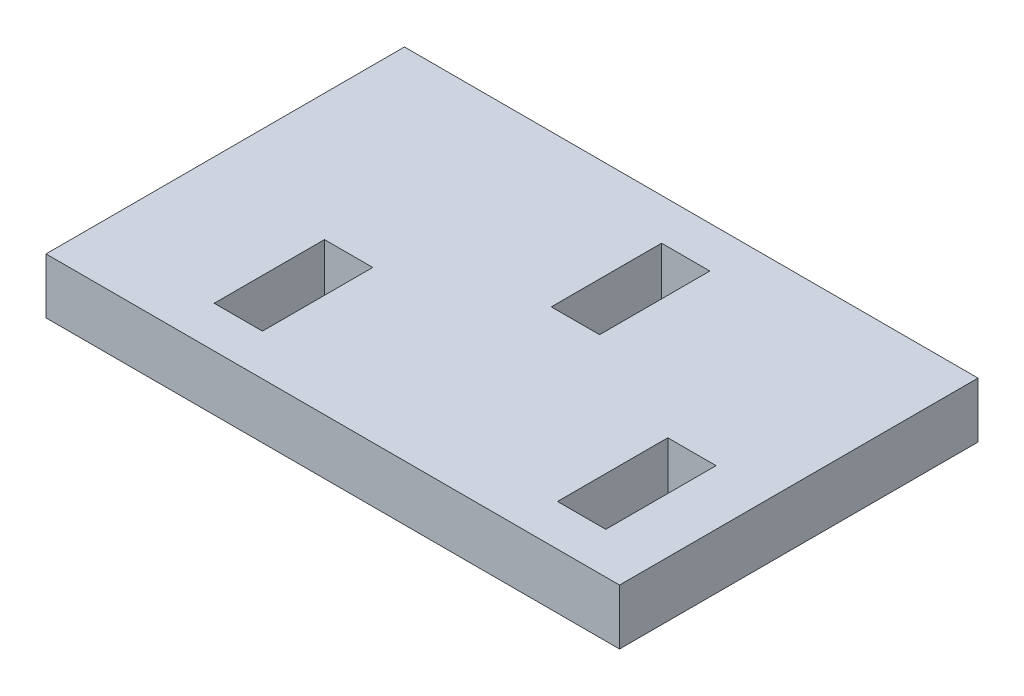
ISO-10303-21;
HEADER;
FILE_DESCRIPTION(('STEP AP214'),'2;1');
FILE_NAME('part.step','',(''),(''),'','','');
FILE_SCHEMA(('AUTOMOTIVE_DESIGN { 1 0 10303 214 1 1 1 1 }'));
ENDSEC;
DATA;
#1=APPLICATION_CONTEXT('core data for automotive mechanical design processes');
#2=APPLICATION_PROTOCOL_DEFINITION('international standard','automotive_design',2000,#1);
#3=PRODUCT_CONTEXT('',#1,'mechanical');
#4=PRODUCT('Part','Part','',(#3));
#5=PRODUCT_RELATED_PRODUCT_CATEGORY('part','',(#4));
#6=PRODUCT_DEFINITION_FORMATION('','',#4);
#7=PRODUCT_DEFINITION_CONTEXT('part definition',#1,'design');
#8=PRODUCT_DEFINITION('design','',#6,#7);
#9=PRODUCT_DEFINITION_SHAPE('','',#8);
#10=(LENGTH_UNIT() NAMED_UNIT(*) SI_UNIT(.MILLI.,.METRE.));
#11=(NAMED_UNIT(*) PLANE_ANGLE_UNIT() SI_UNIT($,.RADIAN.));
#12=(NAMED_UNIT(*) SI_UNIT($,.STERADIAN.) SOLID_ANGLE_UNIT());
#13=UNCERTAINTY_MEASURE_WITH_UNIT(LENGTH_MEASURE(1.E-05),#10,'distance_accuracy_value','');
#14=(GEOMETRIC_REPRESENTATION_CONTEXT(3) GLOBAL_UNCERTAINTY_ASSIGNED_CONTEXT((#13)) GLOBAL_UNIT_ASSIGNED_CONTEXT((#10,
#11,#12)) REPRESENTATION_CONTEXT('',''));
#15=CARTESIAN_POINT('',(0.,0.,0.));
#16=DIRECTION('',(0.,0.,1.));
#17=DIRECTION('',(1.,0.,0.));
#18=AXIS2_PLACEMENT_3D('',#15,#16,#17);
#19=CARTESIAN_POINT('',(26.416,5.1054,16.51));
#20=DIRECTION('',(-1.,0.,0.));
#21=DIRECTION('',(0.,0.,1.));
#22=AXIS2_PLACEMENT_3D('',#19,#20,#21);
#23=PLANE('',#22);
#24=DIRECTION('',(0.,0.,-1.));
#25=VECTOR('',#24,1.);
#26=CARTESIAN_POINT('',(26.416,0.,16.51));
#27=LINE('',#26,#25);
#28=CARTESIAN_POINT('',(26.416,0.,16.51));
#29=VERTEX_POINT('',#28);
#30=CARTESIAN_POINT('',(26.416,0.,-16.51));
#31=VERTEX_POINT('',#30);
#32=EDGE_CURVE('E238',#29,#31,#27,.T.);
#33=ORIENTED_EDGE('',*,*,#32,.T.);
#34=DIRECTION('',(0.,-1.,0.));
#35=VECTOR('',#34,1.);
#36=CARTESIAN_POINT('',(26.416,5.1054,-16.51));
#37=LINE('',#36,#35);
#38=CARTESIAN_POINT('',(26.416,5.1054,-16.51));
#39=VERTEX_POINT('',#38);
#40=EDGE_CURVE('E11',#39,#31,#37,.T.);
#41=ORIENTED_EDGE('',*,*,#40,.F.);
#42=DIRECTION('',(0.,0.,-1.));
#43=VECTOR('',#42,1.);
#44=CARTESIAN_POINT('',(26.416,5.1054,16.51));
#45=LINE('',#44,#43);
#46=CARTESIAN_POINT('',(26.416,5.1054,16.51));
#47=VERTEX_POINT('',#46);
#48=EDGE_CURVE('E245',#47,#39,#45,.T.);
#49=ORIENTED_EDGE('',*,*,#48,.F.);
#50=DIRECTION('',(0.,-1.,0.));
#51=VECTOR('',#50,1.);
#52=CARTESIAN_POINT('',(26.416,5.1054,16.51));
#53=LINE('',#52,#51);
#54=EDGE_CURVE('E255',#47,#29,#53,.T.);
#55=ORIENTED_EDGE('',*,*,#54,.T.);
#56=EDGE_LOOP('',(#33,#41,#49,#55));
#57=FACE_BOUND('',#56,.T.);
#58=ADVANCED_FACE('F32',(#57),#23,.F.);
#59=CARTESIAN_POINT('',(-26.416,5.1054,-16.51));
#60=DIRECTION('',(0.,0.,1.));
#61=DIRECTION('',(1.,0.,0.));
#62=AXIS2_PLACEMENT_3D('',#59,#60,#61);
#63=PLANE('',#62);
#64=DIRECTION('',(-1.,0.,0.));
#65=VECTOR('',#64,1.);
#66=CARTESIAN_POINT('',(-26.416,0.,-16.51));
#67=LINE('',#66,#65);
#68=CARTESIAN_POINT('',(-26.416,0.,-16.51));
#69=VERTEX_POINT('',#68);
#70=EDGE_CURVE('E258',#31,#69,#67,.T.);
#71=ORIENTED_EDGE('',*,*,#70,.T.);
#72=DIRECTION('',(0.,-1.,0.));
#73=VECTOR('',#72,1.);
#74=CARTESIAN_POINT('',(-26.416,5.1054,-16.51));
#75=LINE('',#74,#73);
#76=CARTESIAN_POINT('',(-26.416,5.1054,-16.51));
#77=VERTEX_POINT('',#76);
#78=EDGE_CURVE('E39',#77,#69,#75,.T.);
#79=ORIENTED_EDGE('',*,*,#78,.F.);
#80=DIRECTION('',(-1.,0.,0.));
#81=VECTOR('',#80,1.);
#82=CARTESIAN_POINT('',(-26.416,5.1054,-16.51));
#83=LINE('',#82,#81);
#84=EDGE_CURVE('E248',#39,#77,#83,.T.);
#85=ORIENTED_EDGE('',*,*,#84,.F.);
#86=ORIENTED_EDGE('',*,*,#40,.T.);
#87=EDGE_LOOP('',(#71,#79,#85,#86));
#88=FACE_BOUND('',#87,.T.);
#89=ADVANCED_FACE('F287',(#88),#63,.F.);
#90=CARTESIAN_POINT('',(-26.416,5.1054,16.51));
#91=DIRECTION('',(1.,0.,0.));
#92=DIRECTION('',(0.,0.,-1.));
#93=AXIS2_PLACEMENT_3D('',#90,#91,#92);
#94=PLANE('',#93);
#95=DIRECTION('',(0.,0.,1.));
#96=VECTOR('',#95,1.);
#97=CARTESIAN_POINT('',(-26.416,0.,16.51));
#98=LINE('',#97,#96);
#99=CARTESIAN_POINT('',(-26.416,0.,16.51));
#100=VERTEX_POINT('',#99);
#101=EDGE_CURVE('E260',#69,#100,#98,.T.);
#102=ORIENTED_EDGE('',*,*,#101,.T.);
#103=DIRECTION('',(0.,-1.,0.));
#104=VECTOR('',#103,1.);
#105=CARTESIAN_POINT('',(-26.416,5.1054,16.51));
#106=LINE('',#105,#104);
#107=CARTESIAN_POINT('',(-26.416,5.1054,16.51));
#108=VERTEX_POINT('',#107);
#109=EDGE_CURVE('E265',#108,#100,#106,.T.);
#110=ORIENTED_EDGE('',*,*,#109,.F.);
#111=DIRECTION('',(0.,0.,1.));
#112=VECTOR('',#111,1.);
#113=CARTESIAN_POINT('',(-26.416,5.1054,16.51));
#114=LINE('',#113,#112);
#115=EDGE_CURVE('E251',#77,#108,#114,.T.);
#116=ORIENTED_EDGE('',*,*,#115,.F.);
#117=ORIENTED_EDGE('',*,*,#78,.T.);
#118=EDGE_LOOP('',(#102,#110,#116,#117));
#119=FACE_BOUND('',#118,.T.);
#120=ADVANCED_FACE('F272',(#119),#94,.F.);
#121=CARTESIAN_POINT('',(-26.416,5.1054,16.51));
#122=DIRECTION('',(0.,0.,-1.));
#123=DIRECTION('',(-1.,0.,0.));
#124=AXIS2_PLACEMENT_3D('',#121,#122,#123);
#125=PLANE('',#124);
#126=DIRECTION('',(1.,0.,0.));
#127=VECTOR('',#126,1.);
#128=CARTESIAN_POINT('',(-26.416,0.,16.51));
#129=LINE('',#128,#127);
#130=EDGE_CURVE('E249',#100,#29,#129,.T.);
#131=ORIENTED_EDGE('',*,*,#130,.T.);
#132=ORIENTED_EDGE('',*,*,#54,.F.);
#133=DIRECTION('',(1.,0.,0.));
#134=VECTOR('',#133,1.);
#135=CARTESIAN_POINT('',(-26.416,5.1054,16.51));
#136=LINE('',#135,#134);
#137=EDGE_CURVE('E253',#108,#47,#136,.T.);
#138=ORIENTED_EDGE('',*,*,#137,.F.);
#139=ORIENTED_EDGE('',*,*,#109,.T.);
#140=EDGE_LOOP('',(#131,#132,#138,#139));
#141=FACE_BOUND('',#140,.T.);
#142=ADVANCED_FACE('F280',(#141),#125,.F.);
#143=CARTESIAN_POINT('',(26.416,5.1054,-16.51));
#144=DIRECTION('',(0.,-1.,0.));
#145=DIRECTION('',(0.,0.,-1.));
#146=AXIS2_PLACEMENT_3D('',#143,#144,#145);
#147=PLANE('',#146);
#148=DIRECTION('',(0.,0.,1.));
#149=VECTOR('',#148,1.);
#150=CARTESIAN_POINT('',(-14.732,5.1054,12.7));
#151=LINE('',#150,#149);
#152=CARTESIAN_POINT('',(-14.7319999999999,5.1054,2.54000000000002));
#153=VERTEX_POINT('',#152);
#154=CARTESIAN_POINT('',(-14.732,5.1054,12.7));
#155=VERTEX_POINT('',#154);
#156=EDGE_CURVE('E171',#153,#155,#151,.T.);
#157=ORIENTED_EDGE('',*,*,#156,.F.);
#158=DIRECTION('',(-1.,0.,0.));
#159=VECTOR('',#158,1.);
#160=CARTESIAN_POINT('',(-14.7319999999999,5.1054,2.54000000000002));
#161=LINE('',#160,#159);
#162=CARTESIAN_POINT('',(-10.2869999999999,5.1054,2.54000000000002));
#163=VERTEX_POINT('',#162);
#164=EDGE_CURVE('E46',#163,#153,#161,.T.);
#165=ORIENTED_EDGE('',*,*,#164,.F.);
#166=DIRECTION('',(0.,0.,-1.));
#167=VECTOR('',#166,1.);
#168=CARTESIAN_POINT('',(-10.2869999999999,5.1054,2.54000000000002));
#169=LINE('',#168,#167);
#170=CARTESIAN_POINT('',(-10.287,5.1054,12.7));
#171=VERTEX_POINT('',#170);
#172=EDGE_CURVE('E162',#171,#163,#169,.T.);
#173=ORIENTED_EDGE('',*,*,#172,.F.);
#174=DIRECTION('',(1.,0.,0.));
#175=VECTOR('',#174,1.);
#176=CARTESIAN_POINT('',(-10.287,5.1054,12.7));
#177=LINE('',#176,#175);
#178=EDGE_CURVE('E165',#155,#171,#177,.T.);
#179=ORIENTED_EDGE('',*,*,#178,.F.);
#180=EDGE_LOOP('',(#157,#165,#173,#179));
#181=FACE_BOUND('',#180,.T.);
#182=DIRECTION('',(-1.,0.,0.));
#183=VECTOR('',#182,1.);
#184=CARTESIAN_POINT('',(1.07950000000006,5.1054,-12.7));
#185=LINE('',#184,#183);
#186=CARTESIAN_POINT('',(5.52450000000006,5.1054,-12.7));
#187=VERTEX_POINT('',#186);
#188=CARTESIAN_POINT('',(1.07950000000006,5.1054,-12.7));
#189=VERTEX_POINT('',#188);
#190=EDGE_CURVE('E196',#187,#189,#185,.T.);
#191=ORIENTED_EDGE('',*,*,#190,.F.);
#192=DIRECTION('',(0.,0.,-1.));
#193=VECTOR('',#192,1.);
#194=CARTESIAN_POINT('',(5.52450000000006,5.1054,-12.7));
#195=LINE('',#194,#193);
#196=CARTESIAN_POINT('',(5.52450000000005,5.1054,-2.53999999999998));
#197=VERTEX_POINT('',#196);
#198=EDGE_CURVE('E177',#197,#187,#195,.T.);
#199=ORIENTED_EDGE('',*,*,#198,.F.);
#200=DIRECTION('',(1.,0.,0.));
#201=VECTOR('',#200,1.);
#202=CARTESIAN_POINT('',(5.52450000000005,5.1054,-2.53999999999998));
#203=LINE('',#202,#201);
#204=CARTESIAN_POINT('',(1.07950000000005,5.1054,-2.53999999999998));
#205=VERTEX_POINT('',#204);
#206=EDGE_CURVE('E185',#205,#197,#203,.T.);
#207=ORIENTED_EDGE('',*,*,#206,.F.);
#208=DIRECTION('',(0.,0.,1.));
#209=VECTOR('',#208,1.);
#210=CARTESIAN_POINT('',(1.07950000000005,5.1054,-2.53999999999998));
#211=LINE('',#210,#209);
#212=EDGE_CURVE('E199',#189,#205,#211,.T.);
#213=ORIENTED_EDGE('',*,*,#212,.F.);
#214=EDGE_LOOP('',(#191,#199,#207,#213));
#215=FACE_BOUND('',#214,.T.);
#216=DIRECTION('',(0.,0.,-1.));
#217=VECTOR('',#216,1.);
#218=CARTESIAN_POINT('',(21.336,5.1054,2.54000000000005));
#219=LINE('',#218,#217);
#220=CARTESIAN_POINT('',(21.336,5.1054,12.7000000000001));
#221=VERTEX_POINT('',#220);
#222=CARTESIAN_POINT('',(21.336,5.1054,2.54000000000005));
#223=VERTEX_POINT('',#222);
#224=EDGE_CURVE('E228',#221,#223,#219,.T.);
#225=ORIENTED_EDGE('',*,*,#224,.F.);
#226=DIRECTION('',(1.,0.,0.));
#227=VECTOR('',#226,1.);
#228=CARTESIAN_POINT('',(21.336,5.1054,12.7000000000001));
#229=LINE('',#228,#227);
#230=CARTESIAN_POINT('',(16.891,5.1054,12.7000000000001));
#231=VERTEX_POINT('',#230);
#232=EDGE_CURVE('E206',#231,#221,#229,.T.);
#233=ORIENTED_EDGE('',*,*,#232,.F.);
#234=DIRECTION('',(0.,0.,1.));
#235=VECTOR('',#234,1.);
#236=CARTESIAN_POINT('',(16.891,5.1054,12.7000000000001));
#237=LINE('',#236,#235);
#238=CARTESIAN_POINT('',(16.891,5.1054,2.54000000000005));
#239=VERTEX_POINT('',#238);
#240=EDGE_CURVE('E217',#239,#231,#237,.T.);
#241=ORIENTED_EDGE('',*,*,#240,.F.);
#242=DIRECTION('',(-1.,0.,0.));
#243=VECTOR('',#242,1.);
#244=CARTESIAN_POINT('',(16.891,5.1054,2.54000000000005));
#245=LINE('',#244,#243);
#246=EDGE_CURVE('E231',#223,#239,#245,.T.);
#247=ORIENTED_EDGE('',*,*,#246,.F.);
#248=EDGE_LOOP('',(#225,#233,#241,#247));
#249=FACE_BOUND('',#248,.T.);
#250=ORIENTED_EDGE('',*,*,#48,.T.);
#251=ORIENTED_EDGE('',*,*,#84,.T.);
#252=ORIENTED_EDGE('',*,*,#115,.T.);
#253=ORIENTED_EDGE('',*,*,#137,.T.);
#254=EDGE_LOOP('',(#250,#251,#252,#253));
#255=FACE_BOUND('',#254,.T.);
#256=ADVANCED_FACE('F286',(#181,#215,#249,#255),#147,.F.);
#257=CARTESIAN_POINT('',(26.416,0.,-16.51));
#258=DIRECTION('',(0.,-1.,0.));
#259=DIRECTION('',(0.,0.,-1.));
#260=AXIS2_PLACEMENT_3D('',#257,#258,#259);
#261=PLANE('',#260);
#262=DIRECTION('',(-1.,0.,0.));
#263=VECTOR('',#262,1.);
#264=CARTESIAN_POINT('',(-14.7319999999999,0.,2.54000000000002));
#265=LINE('',#264,#263);
#266=CARTESIAN_POINT('',(-10.2869999999999,0.,2.54000000000002));
#267=VERTEX_POINT('',#266);
#268=CARTESIAN_POINT('',(-14.7319999999999,0.,2.54000000000002));
#269=VERTEX_POINT('',#268);
#270=EDGE_CURVE('E146',#267,#269,#265,.T.);
#271=ORIENTED_EDGE('',*,*,#270,.T.);
#272=DIRECTION('',(0.,0.,1.));
#273=VECTOR('',#272,1.);
#274=CARTESIAN_POINT('',(-14.732,0.,12.7));
#275=LINE('',#274,#273);
#276=CARTESIAN_POINT('',(-14.732,0.,12.7));
#277=VERTEX_POINT('',#276);
#278=EDGE_CURVE('E155',#269,#277,#275,.T.);
#279=ORIENTED_EDGE('',*,*,#278,.T.);
#280=DIRECTION('',(1.,0.,0.));
#281=VECTOR('',#280,1.);
#282=CARTESIAN_POINT('',(-10.287,0.,12.7));
#283=LINE('',#282,#281);
#284=CARTESIAN_POINT('',(-10.287,0.,12.7));
#285=VERTEX_POINT('',#284);
#286=EDGE_CURVE('E54',#277,#285,#283,.T.);
#287=ORIENTED_EDGE('',*,*,#286,.T.);
#288=DIRECTION('',(0.,0.,-1.));
#289=VECTOR('',#288,1.);
#290=CARTESIAN_POINT('',(-10.2869999999999,0.,2.54000000000002));
#291=LINE('',#290,#289);
#292=EDGE_CURVE('E152',#285,#267,#291,.T.);
#293=ORIENTED_EDGE('',*,*,#292,.T.);
#294=EDGE_LOOP('',(#271,#279,#287,#293));
#295=FACE_BOUND('',#294,.T.);
#296=DIRECTION('',(0.,0.,-1.));
#297=VECTOR('',#296,1.);
#298=CARTESIAN_POINT('',(5.52450000000006,0.,-12.7));
#299=LINE('',#298,#297);
#300=CARTESIAN_POINT('',(5.52450000000005,0.,-2.53999999999998));
#301=VERTEX_POINT('',#300);
#302=CARTESIAN_POINT('',(5.52450000000006,0.,-12.7));
#303=VERTEX_POINT('',#302);
#304=EDGE_CURVE('E181',#301,#303,#299,.T.);
#305=ORIENTED_EDGE('',*,*,#304,.T.);
#306=DIRECTION('',(-1.,0.,0.));
#307=VECTOR('',#306,1.);
#308=CARTESIAN_POINT('',(1.07950000000006,0.,-12.7));
#309=LINE('',#308,#307);
#310=CARTESIAN_POINT('',(1.07950000000006,0.,-12.7));
#311=VERTEX_POINT('',#310);
#312=EDGE_CURVE('E184',#303,#311,#309,.T.);
#313=ORIENTED_EDGE('',*,*,#312,.T.);
#314=DIRECTION('',(0.,0.,1.));
#315=VECTOR('',#314,1.);
#316=CARTESIAN_POINT('',(1.07950000000005,0.,-2.53999999999998));
#317=LINE('',#316,#315);
#318=CARTESIAN_POINT('',(1.07950000000005,0.,-2.53999999999998));
#319=VERTEX_POINT('',#318);
#320=EDGE_CURVE('E188',#311,#319,#317,.T.);
#321=ORIENTED_EDGE('',*,*,#320,.T.);
#322=DIRECTION('',(1.,0.,0.));
#323=VECTOR('',#322,1.);
#324=CARTESIAN_POINT('',(5.52450000000005,0.,-2.53999999999998));
#325=LINE('',#324,#323);
#326=EDGE_CURVE('E191',#319,#301,#325,.T.);
#327=ORIENTED_EDGE('',*,*,#326,.T.);
#328=EDGE_LOOP('',(#305,#313,#321,#327));
#329=FACE_BOUND('',#328,.T.);
#330=DIRECTION('',(1.,0.,0.));
#331=VECTOR('',#330,1.);
#332=CARTESIAN_POINT('',(21.336,0.,12.7000000000001));
#333=LINE('',#332,#331);
#334=CARTESIAN_POINT('',(16.891,0.,12.7000000000001));
#335=VERTEX_POINT('',#334);
#336=CARTESIAN_POINT('',(21.336,0.,12.7000000000001));
#337=VERTEX_POINT('',#336);
#338=EDGE_CURVE('E213',#335,#337,#333,.T.);
#339=ORIENTED_EDGE('',*,*,#338,.T.);
#340=DIRECTION('',(0.,0.,-1.));
#341=VECTOR('',#340,1.);
#342=CARTESIAN_POINT('',(21.336,0.,2.54000000000005));
#343=LINE('',#342,#341);
#344=CARTESIAN_POINT('',(21.336,0.,2.54000000000006));
#345=VERTEX_POINT('',#344);
#346=EDGE_CURVE('E216',#337,#345,#343,.T.);
#347=ORIENTED_EDGE('',*,*,#346,.T.);
#348=DIRECTION('',(-1.,0.,0.));
#349=VECTOR('',#348,1.);
#350=CARTESIAN_POINT('',(16.891,0.,2.54000000000005));
#351=LINE('',#350,#349);
#352=CARTESIAN_POINT('',(16.891,0.,2.54000000000005));
#353=VERTEX_POINT('',#352);
#354=EDGE_CURVE('E220',#345,#353,#351,.T.);
#355=ORIENTED_EDGE('',*,*,#354,.T.);
#356=DIRECTION('',(0.,0.,1.));
#357=VECTOR('',#356,1.);
#358=CARTESIAN_POINT('',(16.891,0.,12.7000000000001));
#359=LINE('',#358,#357);
#360=EDGE_CURVE('E223',#353,#335,#359,.T.);
#361=ORIENTED_EDGE('',*,*,#360,.T.);
#362=EDGE_LOOP('',(#339,#347,#355,#361));
#363=FACE_BOUND('',#362,.T.);
#364=ORIENTED_EDGE('',*,*,#32,.F.);
#365=ORIENTED_EDGE('',*,*,#130,.F.);
#366=ORIENTED_EDGE('',*,*,#101,.F.);
#367=ORIENTED_EDGE('',*,*,#70,.F.);
#368=EDGE_LOOP('',(#364,#365,#366,#367));
#369=FACE_BOUND('',#368,.T.);
#370=ADVANCED_FACE('F159',(#295,#329,#363,#369),#261,.T.);
#371=CARTESIAN_POINT('',(21.336,0.,12.7000000000001));
#372=DIRECTION('',(0.,0.,1.));
#373=DIRECTION('',(1.,0.,0.));
#374=AXIS2_PLACEMENT_3D('',#371,#372,#373);
#375=PLANE('',#374);
#376=ORIENTED_EDGE('',*,*,#232,.T.);
#377=DIRECTION('',(0.,1.,0.));
#378=VECTOR('',#377,1.);
#379=CARTESIAN_POINT('',(21.336,0.,12.7000000000001));
#380=LINE('',#379,#378);
#381=EDGE_CURVE('E226',#337,#221,#380,.T.);
#382=ORIENTED_EDGE('',*,*,#381,.F.);
#383=ORIENTED_EDGE('',*,*,#338,.F.);
#384=DIRECTION('',(0.,1.,0.));
#385=VECTOR('',#384,1.);
#386=CARTESIAN_POINT('',(16.891,0.,12.7000000000001));
#387=LINE('',#386,#385);
#388=EDGE_CURVE('E236',#335,#231,#387,.T.);
#389=ORIENTED_EDGE('',*,*,#388,.T.);
#390=EDGE_LOOP('',(#376,#382,#383,#389));
#391=FACE_BOUND('',#390,.T.);
#392=ADVANCED_FACE('F299',(#391),#375,.F.);
#393=CARTESIAN_POINT('',(16.891,0.,12.7000000000001));
#394=DIRECTION('',(-1.,0.,0.));
#395=DIRECTION('',(0.,0.,1.));
#396=AXIS2_PLACEMENT_3D('',#393,#394,#395);
#397=PLANE('',#396);
#398=ORIENTED_EDGE('',*,*,#240,.T.);
#399=ORIENTED_EDGE('',*,*,#388,.F.);
#400=ORIENTED_EDGE('',*,*,#360,.F.);
#401=DIRECTION('',(0.,1.,0.));
#402=VECTOR('',#401,1.);
#403=CARTESIAN_POINT('',(16.891,0.,2.54000000000005));
#404=LINE('',#403,#402);
#405=EDGE_CURVE('E239',#353,#239,#404,.T.);
#406=ORIENTED_EDGE('',*,*,#405,.T.);
#407=EDGE_LOOP('',(#398,#399,#400,#406));
#408=FACE_BOUND('',#407,.T.);
#409=ADVANCED_FACE('F305',(#408),#397,.F.);
#410=CARTESIAN_POINT('',(16.891,0.,2.54000000000005));
#411=DIRECTION('',(0.,0.,-1.));
#412=DIRECTION('',(-1.,0.,0.));
#413=AXIS2_PLACEMENT_3D('',#410,#411,#412);
#414=PLANE('',#413);
#415=ORIENTED_EDGE('',*,*,#246,.T.);
#416=ORIENTED_EDGE('',*,*,#405,.F.);
#417=ORIENTED_EDGE('',*,*,#354,.F.);
#418=DIRECTION('',(0.,1.,0.));
#419=VECTOR('',#418,1.);
#420=CARTESIAN_POINT('',(21.336,0.,2.54000000000005));
#421=LINE('',#420,#419);
#422=EDGE_CURVE('E241',#345,#223,#421,.T.);
#423=ORIENTED_EDGE('',*,*,#422,.T.);
#424=EDGE_LOOP('',(#415,#416,#417,#423));
#425=FACE_BOUND('',#424,.T.);
#426=ADVANCED_FACE('F311',(#425),#414,.F.);
#427=CARTESIAN_POINT('',(21.336,0.,2.54000000000005));
#428=DIRECTION('',(1.,0.,0.));
#429=DIRECTION('',(0.,0.,-1.));
#430=AXIS2_PLACEMENT_3D('',#427,#428,#429);
#431=PLANE('',#430);
#432=ORIENTED_EDGE('',*,*,#224,.T.);
#433=ORIENTED_EDGE('',*,*,#422,.F.);
#434=ORIENTED_EDGE('',*,*,#346,.F.);
#435=ORIENTED_EDGE('',*,*,#381,.T.);
#436=EDGE_LOOP('',(#432,#433,#434,#435));
#437=FACE_BOUND('',#436,.T.);
#438=ADVANCED_FACE('F307',(#437),#431,.F.);
#439=CARTESIAN_POINT('',(5.52450000000006,0.,-12.7));
#440=DIRECTION('',(1.,0.,0.));
#441=DIRECTION('',(0.,0.,-1.));
#442=AXIS2_PLACEMENT_3D('',#439,#440,#441);
#443=PLANE('',#442);
#444=ORIENTED_EDGE('',*,*,#198,.T.);
#445=DIRECTION('',(0.,1.,0.));
#446=VECTOR('',#445,1.);
#447=CARTESIAN_POINT('',(5.52450000000006,0.,-12.7));
#448=LINE('',#447,#446);
#449=EDGE_CURVE('E194',#303,#187,#448,.T.);
#450=ORIENTED_EDGE('',*,*,#449,.F.);
#451=ORIENTED_EDGE('',*,*,#304,.F.);
#452=DIRECTION('',(0.,1.,0.));
#453=VECTOR('',#452,1.);
#454=CARTESIAN_POINT('',(5.52450000000005,0.,-2.53999999999998));
#455=LINE('',#454,#453);
#456=EDGE_CURVE('E204',#301,#197,#455,.T.);
#457=ORIENTED_EDGE('',*,*,#456,.T.);
#458=EDGE_LOOP('',(#444,#450,#451,#457));
#459=FACE_BOUND('',#458,.T.);
#460=ADVANCED_FACE('F310',(#459),#443,.F.);
#461=CARTESIAN_POINT('',(5.52450000000005,0.,-2.53999999999998));
#462=DIRECTION('',(0.,0.,1.));
#463=DIRECTION('',(1.,0.,0.));
#464=AXIS2_PLACEMENT_3D('',#461,#462,#463);
#465=PLANE('',#464);
#466=ORIENTED_EDGE('',*,*,#206,.T.);
#467=ORIENTED_EDGE('',*,*,#456,.F.);
#468=ORIENTED_EDGE('',*,*,#326,.F.);
#469=DIRECTION('',(0.,1.,0.));
#470=VECTOR('',#469,1.);
#471=CARTESIAN_POINT('',(1.07950000000005,0.,-2.53999999999998));
#472=LINE('',#471,#470);
#473=EDGE_CURVE('E207',#319,#205,#472,.T.);
#474=ORIENTED_EDGE('',*,*,#473,.T.);
#475=EDGE_LOOP('',(#466,#467,#468,#474));
#476=FACE_BOUND('',#475,.T.);
#477=ADVANCED_FACE('F321',(#476),#465,.F.);
#478=CARTESIAN_POINT('',(1.07950000000005,0.,-2.53999999999998));
#479=DIRECTION('',(-1.,0.,0.));
#480=DIRECTION('',(0.,0.,1.));
#481=AXIS2_PLACEMENT_3D('',#478,#479,#480);
#482=PLANE('',#481);
#483=ORIENTED_EDGE('',*,*,#212,.T.);
#484=ORIENTED_EDGE('',*,*,#473,.F.);
#485=ORIENTED_EDGE('',*,*,#320,.F.);
#486=DIRECTION('',(0.,1.,0.));
#487=VECTOR('',#486,1.);
#488=CARTESIAN_POINT('',(1.07950000000006,0.,-12.7));
#489=LINE('',#488,#487);
#490=EDGE_CURVE('E209',#311,#189,#489,.T.);
#491=ORIENTED_EDGE('',*,*,#490,.T.);
#492=EDGE_LOOP('',(#483,#484,#485,#491));
#493=FACE_BOUND('',#492,.T.);
#494=ADVANCED_FACE('F326',(#493),#482,.F.);
#495=CARTESIAN_POINT('',(1.07950000000006,0.,-12.7));
#496=DIRECTION('',(0.,0.,-1.));
#497=DIRECTION('',(-1.,0.,0.));
#498=AXIS2_PLACEMENT_3D('',#495,#496,#497);
#499=PLANE('',#498);
#500=ORIENTED_EDGE('',*,*,#190,.T.);
#501=ORIENTED_EDGE('',*,*,#490,.F.);
#502=ORIENTED_EDGE('',*,*,#312,.F.);
#503=ORIENTED_EDGE('',*,*,#449,.T.);
#504=EDGE_LOOP('',(#500,#501,#502,#503));
#505=FACE_BOUND('',#504,.T.);
#506=ADVANCED_FACE('F323',(#505),#499,.F.);
#507=CARTESIAN_POINT('',(-14.7319999999999,0.,2.54000000000002));
#508=DIRECTION('',(0.,0.,-1.));
#509=DIRECTION('',(-1.,0.,0.));
#510=AXIS2_PLACEMENT_3D('',#507,#508,#509);
#511=PLANE('',#510);
#512=ORIENTED_EDGE('',*,*,#164,.T.);
#513=DIRECTION('',(0.,1.,0.));
#514=VECTOR('',#513,1.);
#515=CARTESIAN_POINT('',(-14.7319999999999,0.,2.54000000000002));
#516=LINE('',#515,#514);
#517=EDGE_CURVE('E142',#269,#153,#516,.T.);
#518=ORIENTED_EDGE('',*,*,#517,.F.);
#519=ORIENTED_EDGE('',*,*,#270,.F.);
#520=DIRECTION('',(0.,1.,0.));
#521=VECTOR('',#520,1.);
#522=CARTESIAN_POINT('',(-10.2869999999999,0.,2.54000000000002));
#523=LINE('',#522,#521);
#524=EDGE_CURVE('E175',#267,#163,#523,.T.);
#525=ORIENTED_EDGE('',*,*,#524,.T.);
#526=EDGE_LOOP('',(#512,#518,#519,#525));
#527=FACE_BOUND('',#526,.T.);
#528=ADVANCED_FACE('F144',(#527),#511,.F.);
#529=CARTESIAN_POINT('',(-10.2869999999999,0.,2.54000000000002));
#530=DIRECTION('',(1.,0.,0.));
#531=DIRECTION('',(0.,0.,-1.));
#532=AXIS2_PLACEMENT_3D('',#529,#530,#531);
#533=PLANE('',#532);
#534=ORIENTED_EDGE('',*,*,#172,.T.);
#535=ORIENTED_EDGE('',*,*,#524,.F.);
#536=ORIENTED_EDGE('',*,*,#292,.F.);
#537=DIRECTION('',(0.,1.,0.));
#538=VECTOR('',#537,1.);
#539=CARTESIAN_POINT('',(-10.287,0.,12.7));
#540=LINE('',#539,#538);
#541=EDGE_CURVE('E178',#285,#171,#540,.T.);
#542=ORIENTED_EDGE('',*,*,#541,.T.);
#543=EDGE_LOOP('',(#534,#535,#536,#542));
#544=FACE_BOUND('',#543,.T.);
#545=ADVANCED_FACE('F336',(#544),#533,.F.);
#546=CARTESIAN_POINT('',(-10.287,0.,12.7));
#547=DIRECTION('',(0.,0.,1.));
#548=DIRECTION('',(1.,0.,0.));
#549=AXIS2_PLACEMENT_3D('',#546,#547,#548);
#550=PLANE('',#549);
#551=ORIENTED_EDGE('',*,*,#178,.T.);
#552=ORIENTED_EDGE('',*,*,#541,.F.);
#553=ORIENTED_EDGE('',*,*,#286,.F.);
#554=DIRECTION('',(0.,1.,0.));
#555=VECTOR('',#554,1.);
#556=CARTESIAN_POINT('',(-14.732,0.,12.7));
#557=LINE('',#556,#555);
#558=EDGE_CURVE('E151',#277,#155,#557,.T.);
#559=ORIENTED_EDGE('',*,*,#558,.T.);
#560=EDGE_LOOP('',(#551,#552,#553,#559));
#561=FACE_BOUND('',#560,.T.);
#562=ADVANCED_FACE('F339',(#561),#550,.F.);
#563=CARTESIAN_POINT('',(-14.732,0.,12.7));
#564=DIRECTION('',(-1.,0.,0.));
#565=DIRECTION('',(0.,0.,1.));
#566=AXIS2_PLACEMENT_3D('',#563,#564,#565);
#567=PLANE('',#566);
#568=ORIENTED_EDGE('',*,*,#156,.T.);
#569=ORIENTED_EDGE('',*,*,#558,.F.);
#570=ORIENTED_EDGE('',*,*,#278,.F.);
#571=ORIENTED_EDGE('',*,*,#517,.T.);
#572=EDGE_LOOP('',(#568,#569,#570,#571));
#573=FACE_BOUND('',#572,.T.);
#574=ADVANCED_FACE('F156',(#573),#567,.F.);
#575=CLOSED_SHELL('',(#58,#89,#120,#142,#256,#370,#392,#409,#426,#438,#460,#477,#494,#506,#528,
#545,#562,#574));
#576=MANIFOLD_SOLID_BREP('B2',#575);
#577=ADVANCED_BREP_SHAPE_REPRESENTATION('',(#18,#576),#14);
#578=SHAPE_DEFINITION_REPRESENTATION(#9,#577);
ENDSEC;
END-ISO-10303-21;
